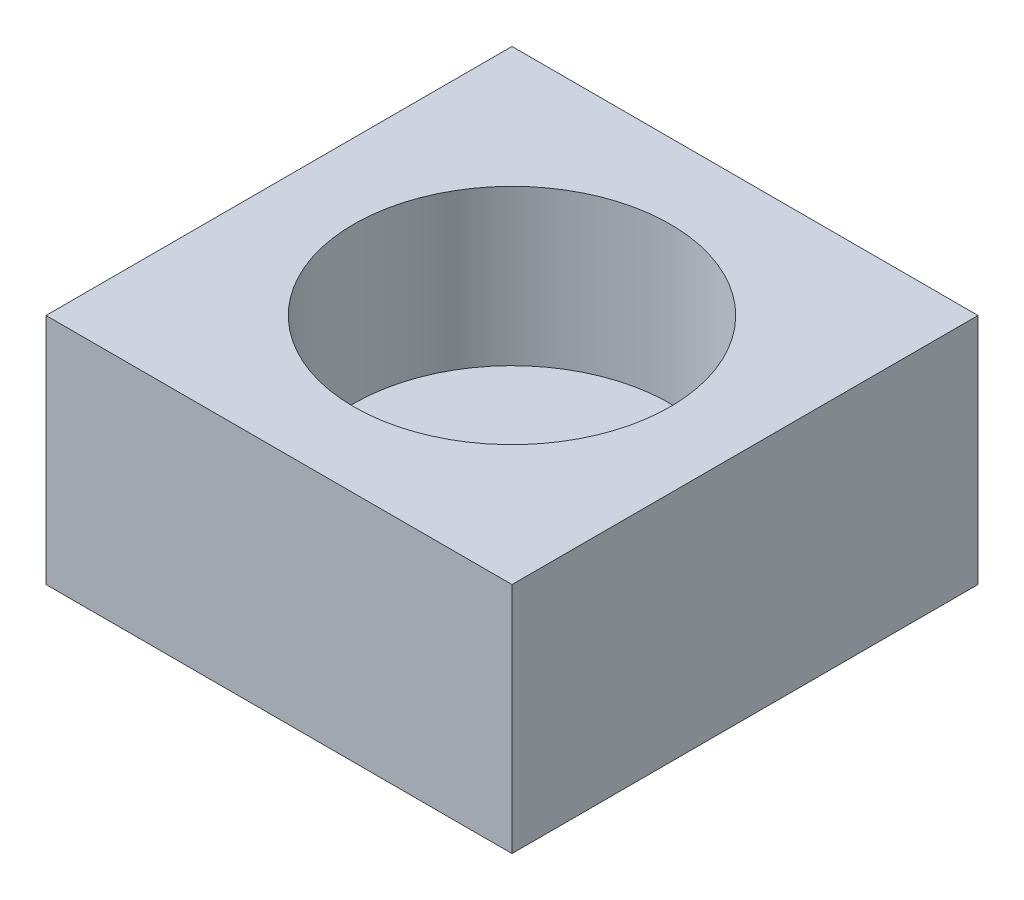
ISO-10303-21;
HEADER;
FILE_DESCRIPTION(('STEP AP214'),'2;1');
FILE_NAME('part.step','',(''),(''),'','','');
FILE_SCHEMA(('AUTOMOTIVE_DESIGN { 1 0 10303 214 1 1 1 1 }'));
ENDSEC;
DATA;
#1=APPLICATION_CONTEXT('core data for automotive mechanical design processes');
#2=APPLICATION_PROTOCOL_DEFINITION('international standard','automotive_design',2000,#1);
#3=PRODUCT_CONTEXT('',#1,'mechanical');
#4=PRODUCT('Part','Part','',(#3));
#5=PRODUCT_RELATED_PRODUCT_CATEGORY('part','',(#4));
#6=PRODUCT_DEFINITION_FORMATION('','',#4);
#7=PRODUCT_DEFINITION_CONTEXT('part definition',#1,'design');
#8=PRODUCT_DEFINITION('design','',#6,#7);
#9=PRODUCT_DEFINITION_SHAPE('','',#8);
#10=(LENGTH_UNIT() NAMED_UNIT(*) SI_UNIT(.MILLI.,.METRE.));
#11=(NAMED_UNIT(*) PLANE_ANGLE_UNIT() SI_UNIT($,.RADIAN.));
#12=(NAMED_UNIT(*) SI_UNIT($,.STERADIAN.) SOLID_ANGLE_UNIT());
#13=UNCERTAINTY_MEASURE_WITH_UNIT(LENGTH_MEASURE(1.E-05),#10,'distance_accuracy_value','');
#14=(GEOMETRIC_REPRESENTATION_CONTEXT(3) GLOBAL_UNCERTAINTY_ASSIGNED_CONTEXT((#13)) GLOBAL_UNIT_ASSIGNED_CONTEXT((#10,
#11,#12)) REPRESENTATION_CONTEXT('',''));
#15=CARTESIAN_POINT('',(0.,0.,0.));
#16=DIRECTION('',(0.,0.,1.));
#17=DIRECTION('',(1.,0.,0.));
#18=AXIS2_PLACEMENT_3D('',#15,#16,#17);
#19=CARTESIAN_POINT('',(0.,3.,0.));
#20=DIRECTION('',(1.,0.,0.));
#21=DIRECTION('',(0.,0.,-1.));
#22=AXIS2_PLACEMENT_3D('',#19,#20,#21);
#23=PLANE('',#22);
#24=DIRECTION('',(0.,0.,1.));
#25=VECTOR('',#24,1.);
#26=CARTESIAN_POINT('',(0.,0.,0.));
#27=LINE('',#26,#25);
#28=CARTESIAN_POINT('',(0.,0.,-6.00000000000001));
#29=VERTEX_POINT('',#28);
#30=CARTESIAN_POINT('',(0.,0.,0.));
#31=VERTEX_POINT('',#30);
#32=EDGE_CURVE('E74',#29,#31,#27,.T.);
#33=ORIENTED_EDGE('',*,*,#32,.T.);
#34=DIRECTION('',(0.,-1.,0.));
#35=VECTOR('',#34,1.);
#36=CARTESIAN_POINT('',(0.,3.,0.));
#37=LINE('',#36,#35);
#38=CARTESIAN_POINT('',(0.,3.,0.));
#39=VERTEX_POINT('',#38);
#40=EDGE_CURVE('E11',#39,#31,#37,.T.);
#41=ORIENTED_EDGE('',*,*,#40,.F.);
#42=DIRECTION('',(0.,0.,1.));
#43=VECTOR('',#42,1.);
#44=CARTESIAN_POINT('',(0.,3.,0.));
#45=LINE('',#44,#43);
#46=CARTESIAN_POINT('',(0.,3.,-6.00000000000001));
#47=VERTEX_POINT('',#46);
#48=EDGE_CURVE('E97',#47,#39,#45,.T.);
#49=ORIENTED_EDGE('',*,*,#48,.F.);
#50=DIRECTION('',(0.,-1.,0.));
#51=VECTOR('',#50,1.);
#52=CARTESIAN_POINT('',(0.,3.,-6.00000000000001));
#53=LINE('',#52,#51);
#54=EDGE_CURVE('E86',#47,#29,#53,.T.);
#55=ORIENTED_EDGE('',*,*,#54,.T.);
#56=EDGE_LOOP('',(#33,#41,#49,#55));
#57=FACE_BOUND('',#56,.T.);
#58=ADVANCED_FACE('F30',(#57),#23,.F.);
#59=CARTESIAN_POINT('',(0.,3.,0.));
#60=DIRECTION('',(0.,0.,-1.));
#61=DIRECTION('',(-1.,0.,0.));
#62=AXIS2_PLACEMENT_3D('',#59,#60,#61);
#63=PLANE('',#62);
#64=DIRECTION('',(1.,0.,0.));
#65=VECTOR('',#64,1.);
#66=CARTESIAN_POINT('',(0.,0.,0.));
#67=LINE('',#66,#65);
#68=CARTESIAN_POINT('',(6.,0.,0.));
#69=VERTEX_POINT('',#68);
#70=EDGE_CURVE('E70',#31,#69,#67,.T.);
#71=ORIENTED_EDGE('',*,*,#70,.T.);
#72=DIRECTION('',(0.,-1.,0.));
#73=VECTOR('',#72,1.);
#74=CARTESIAN_POINT('',(6.,3.,0.));
#75=LINE('',#74,#73);
#76=CARTESIAN_POINT('',(6.,3.,0.));
#77=VERTEX_POINT('',#76);
#78=EDGE_CURVE('E37',#77,#69,#75,.T.);
#79=ORIENTED_EDGE('',*,*,#78,.F.);
#80=DIRECTION('',(1.,0.,0.));
#81=VECTOR('',#80,1.);
#82=CARTESIAN_POINT('',(0.,3.,0.));
#83=LINE('',#82,#81);
#84=EDGE_CURVE('E82',#39,#77,#83,.T.);
#85=ORIENTED_EDGE('',*,*,#84,.F.);
#86=ORIENTED_EDGE('',*,*,#40,.T.);
#87=EDGE_LOOP('',(#71,#79,#85,#86));
#88=FACE_BOUND('',#87,.T.);
#89=ADVANCED_FACE('F81',(#88),#63,.F.);
#90=CARTESIAN_POINT('',(6.,3.,0.));
#91=DIRECTION('',(-1.,0.,0.));
#92=DIRECTION('',(0.,0.,1.));
#93=AXIS2_PLACEMENT_3D('',#90,#91,#92);
#94=PLANE('',#93);
#95=DIRECTION('',(0.,0.,-1.));
#96=VECTOR('',#95,1.);
#97=CARTESIAN_POINT('',(6.,0.,0.));
#98=LINE('',#97,#96);
#99=CARTESIAN_POINT('',(6.,0.,-6.));
#100=VERTEX_POINT('',#99);
#101=EDGE_CURVE('E75',#69,#100,#98,.T.);
#102=ORIENTED_EDGE('',*,*,#101,.T.);
#103=DIRECTION('',(0.,-1.,0.));
#104=VECTOR('',#103,1.);
#105=CARTESIAN_POINT('',(6.,3.,-6.));
#106=LINE('',#105,#104);
#107=CARTESIAN_POINT('',(6.,3.,-6.));
#108=VERTEX_POINT('',#107);
#109=EDGE_CURVE('E103',#108,#100,#106,.T.);
#110=ORIENTED_EDGE('',*,*,#109,.F.);
#111=DIRECTION('',(0.,0.,-1.));
#112=VECTOR('',#111,1.);
#113=CARTESIAN_POINT('',(6.,3.,0.));
#114=LINE('',#113,#112);
#115=EDGE_CURVE('E49',#77,#108,#114,.T.);
#116=ORIENTED_EDGE('',*,*,#115,.F.);
#117=ORIENTED_EDGE('',*,*,#78,.T.);
#118=EDGE_LOOP('',(#102,#110,#116,#117));
#119=FACE_BOUND('',#118,.T.);
#120=ADVANCED_FACE('F106',(#119),#94,.F.);
#121=CARTESIAN_POINT('',(0.,3.,-6.00000000000001));
#122=DIRECTION('',(0.,0.,1.));
#123=DIRECTION('',(1.,0.,0.));
#124=AXIS2_PLACEMENT_3D('',#121,#122,#123);
#125=PLANE('',#124);
#126=DIRECTION('',(-1.,0.,0.));
#127=VECTOR('',#126,1.);
#128=CARTESIAN_POINT('',(0.,0.,-6.00000000000001));
#129=LINE('',#128,#127);
#130=EDGE_CURVE('E95',#100,#29,#129,.T.);
#131=ORIENTED_EDGE('',*,*,#130,.T.);
#132=ORIENTED_EDGE('',*,*,#54,.F.);
#133=DIRECTION('',(-1.,0.,0.));
#134=VECTOR('',#133,1.);
#135=CARTESIAN_POINT('',(0.,3.,-6.00000000000001));
#136=LINE('',#135,#134);
#137=EDGE_CURVE('E44',#108,#47,#136,.T.);
#138=ORIENTED_EDGE('',*,*,#137,.F.);
#139=ORIENTED_EDGE('',*,*,#109,.T.);
#140=EDGE_LOOP('',(#131,#132,#138,#139));
#141=FACE_BOUND('',#140,.T.);
#142=ADVANCED_FACE('F108',(#141),#125,.F.);
#143=CARTESIAN_POINT('',(0.,3.,0.));
#144=DIRECTION('',(0.,-1.,0.));
#145=DIRECTION('',(0.,0.,-1.));
#146=AXIS2_PLACEMENT_3D('',#143,#144,#145);
#147=PLANE('',#146);
#148=CARTESIAN_POINT('',(3.,3.,-3.));
#149=DIRECTION('',(0.,1.,0.));
#150=DIRECTION('',(0.,0.,1.));
#151=AXIS2_PLACEMENT_3D('',#148,#149,#150);
#152=CIRCLE('',#151,2.03709929576328);
#153=CARTESIAN_POINT('',(3.,3.,-0.962900704236727));
#154=VERTEX_POINT('',#153);
#155=EDGE_CURVE('E90',#154,#154,#152,.T.);
#156=ORIENTED_EDGE('',*,*,#155,.F.);
#157=EDGE_LOOP('',(#156));
#158=FACE_BOUND('',#157,.T.);
#159=ORIENTED_EDGE('',*,*,#48,.T.);
#160=ORIENTED_EDGE('',*,*,#84,.T.);
#161=ORIENTED_EDGE('',*,*,#115,.T.);
#162=ORIENTED_EDGE('',*,*,#137,.T.);
#163=EDGE_LOOP('',(#159,#160,#161,#162));
#164=FACE_BOUND('',#163,.T.);
#165=ADVANCED_FACE('F109',(#158,#164),#147,.F.);
#166=CARTESIAN_POINT('',(0.,0.,0.));
#167=DIRECTION('',(0.,-1.,0.));
#168=DIRECTION('',(0.,0.,-1.));
#169=AXIS2_PLACEMENT_3D('',#166,#167,#168);
#170=PLANE('',#169);
#171=ORIENTED_EDGE('',*,*,#32,.F.);
#172=ORIENTED_EDGE('',*,*,#130,.F.);
#173=ORIENTED_EDGE('',*,*,#101,.F.);
#174=ORIENTED_EDGE('',*,*,#70,.F.);
#175=EDGE_LOOP('',(#171,#172,#173,#174));
#176=FACE_BOUND('',#175,.T.);
#177=ADVANCED_FACE('F71',(#176),#170,.T.);
#178=CARTESIAN_POINT('',(3.,1.,-3.));
#179=DIRECTION('',(0.,1.,0.));
#180=DIRECTION('',(0.,0.,1.));
#181=AXIS2_PLACEMENT_3D('',#178,#179,#180);
#182=CYLINDRICAL_SURFACE('',#181,2.03709929576328);
#183=CARTESIAN_POINT('',(3.,1.,-3.));
#184=DIRECTION('',(0.,1.,0.));
#185=DIRECTION('',(0.,0.,1.));
#186=AXIS2_PLACEMENT_3D('',#183,#184,#185);
#187=CIRCLE('',#186,2.03709929576328);
#188=CARTESIAN_POINT('',(3.,1.,-0.962900704236727));
#189=VERTEX_POINT('',#188);
#190=EDGE_CURVE('E87',#189,#189,#187,.T.);
#191=ORIENTED_EDGE('',*,*,#190,.F.);
#192=EDGE_LOOP('',(#191));
#193=FACE_BOUND('',#192,.T.);
#194=ORIENTED_EDGE('',*,*,#155,.T.);
#195=EDGE_LOOP('',(#194));
#196=FACE_BOUND('',#195,.T.);
#197=ADVANCED_FACE('F117',(#193,#196),#182,.F.);
#198=CARTESIAN_POINT('',(3.,1.,-3.));
#199=DIRECTION('',(0.,1.,0.));
#200=DIRECTION('',(0.,0.,1.));
#201=AXIS2_PLACEMENT_3D('',#198,#199,#200);
#202=PLANE('',#201);
#203=ORIENTED_EDGE('',*,*,#190,.T.);
#204=EDGE_LOOP('',(#203));
#205=FACE_BOUND('',#204,.T.);
#206=ADVANCED_FACE('F154',(#205),#202,.T.);
#207=CLOSED_SHELL('',(#58,#89,#120,#142,#165,#177,#197,#206));
#208=MANIFOLD_SOLID_BREP('B2',#207);
#209=ADVANCED_BREP_SHAPE_REPRESENTATION('',(#18,#208),#14);
#210=SHAPE_DEFINITION_REPRESENTATION(#9,#209);
ENDSEC;
END-ISO-10303-21;
